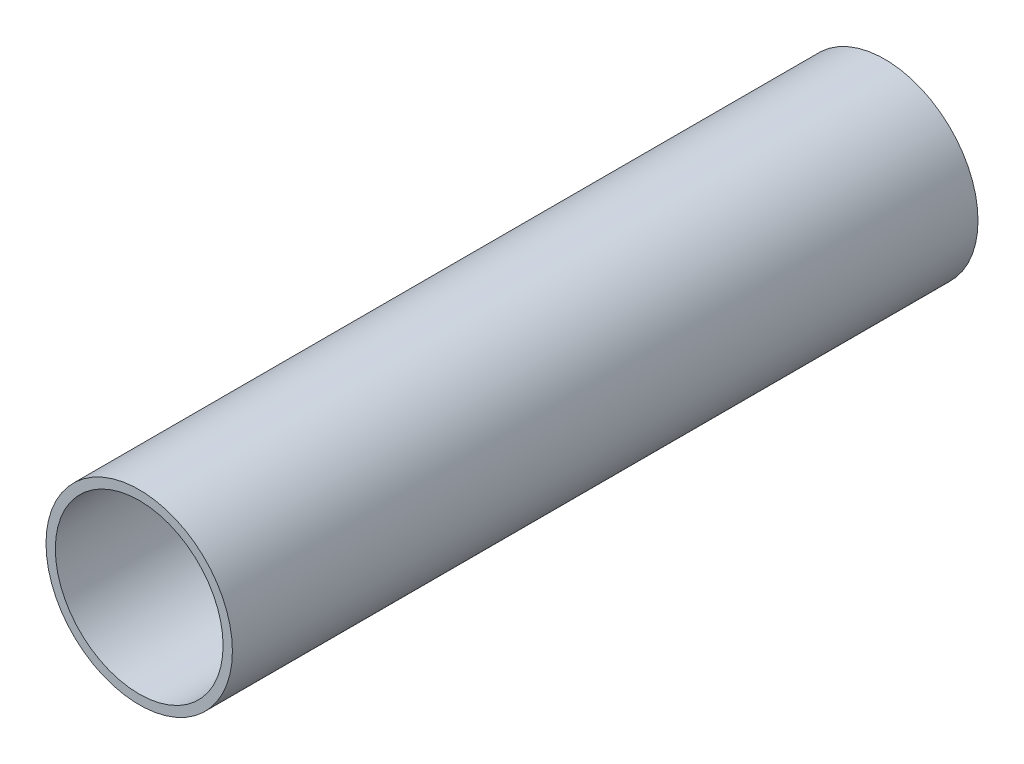
ISO-10303-21;
HEADER;
FILE_DESCRIPTION(('STEP AP214'),'2;1');
FILE_NAME('part.step','',(''),(''),'','','');
FILE_SCHEMA(('AUTOMOTIVE_DESIGN { 1 0 10303 214 1 1 1 1 }'));
ENDSEC;
DATA;
#1=APPLICATION_CONTEXT('core data for automotive mechanical design processes');
#2=APPLICATION_PROTOCOL_DEFINITION('international standard','automotive_design',2000,#1);
#3=PRODUCT_CONTEXT('',#1,'mechanical');
#4=PRODUCT('Part','Part','',(#3));
#5=PRODUCT_RELATED_PRODUCT_CATEGORY('part','',(#4));
#6=PRODUCT_DEFINITION_FORMATION('','',#4);
#7=PRODUCT_DEFINITION_CONTEXT('part definition',#1,'design');
#8=PRODUCT_DEFINITION('design','',#6,#7);
#9=PRODUCT_DEFINITION_SHAPE('','',#8);
#10=(LENGTH_UNIT() NAMED_UNIT(*) SI_UNIT(.MILLI.,.METRE.));
#11=(NAMED_UNIT(*) PLANE_ANGLE_UNIT() SI_UNIT($,.RADIAN.));
#12=(NAMED_UNIT(*) SI_UNIT($,.STERADIAN.) SOLID_ANGLE_UNIT());
#13=UNCERTAINTY_MEASURE_WITH_UNIT(LENGTH_MEASURE(1.E-05),#10,'distance_accuracy_value','');
#14=(GEOMETRIC_REPRESENTATION_CONTEXT(3) GLOBAL_UNCERTAINTY_ASSIGNED_CONTEXT((#13)) GLOBAL_UNIT_ASSIGNED_CONTEXT((#10,
#11,#12)) REPRESENTATION_CONTEXT('',''));
#15=CARTESIAN_POINT('',(0.,0.,0.));
#16=DIRECTION('',(0.,0.,1.));
#17=DIRECTION('',(1.,0.,0.));
#18=AXIS2_PLACEMENT_3D('',#15,#16,#17);
#19=CARTESIAN_POINT('',(0.,0.,400.));
#20=DIRECTION('',(0.,0.,1.));
#21=DIRECTION('',(1.,0.,0.));
#22=AXIS2_PLACEMENT_3D('',#19,#20,#21);
#23=PLANE('',#22);
#24=CARTESIAN_POINT('',(0.,0.,400.));
#25=DIRECTION('',(0.,0.,1.));
#26=DIRECTION('',(1.,0.,0.));
#27=AXIS2_PLACEMENT_3D('',#24,#25,#26);
#28=CIRCLE('',#27,50.);
#29=CARTESIAN_POINT('',(50.,0.,400.));
#30=VERTEX_POINT('',#29);
#31=EDGE_CURVE('E10',#30,#30,#28,.T.);
#32=ORIENTED_EDGE('',*,*,#31,.T.);
#33=EDGE_LOOP('',(#32));
#34=FACE_BOUND('',#33,.T.);
#35=CARTESIAN_POINT('',(0.,0.,400.));
#36=DIRECTION('',(0.,0.,1.));
#37=DIRECTION('',(1.,0.,0.));
#38=AXIS2_PLACEMENT_3D('',#35,#36,#37);
#39=CIRCLE('',#38,45.);
#40=CARTESIAN_POINT('',(45.,0.,400.));
#41=VERTEX_POINT('',#40);
#42=EDGE_CURVE('E56',#41,#41,#39,.T.);
#43=ORIENTED_EDGE('',*,*,#42,.F.);
#44=EDGE_LOOP('',(#43));
#45=FACE_BOUND('',#44,.T.);
#46=ADVANCED_FACE('F43',(#34,#45),#23,.T.);
#47=CARTESIAN_POINT('',(0.,0.,0.));
#48=DIRECTION('',(0.,0.,1.));
#49=DIRECTION('',(1.,0.,0.));
#50=AXIS2_PLACEMENT_3D('',#47,#48,#49);
#51=PLANE('',#50);
#52=CARTESIAN_POINT('',(0.,0.,0.));
#53=DIRECTION('',(0.,0.,1.));
#54=DIRECTION('',(1.,0.,0.));
#55=AXIS2_PLACEMENT_3D('',#52,#53,#54);
#56=CIRCLE('',#55,50.);
#57=CARTESIAN_POINT('',(50.,0.,0.));
#58=VERTEX_POINT('',#57);
#59=EDGE_CURVE('E47',#58,#58,#56,.T.);
#60=ORIENTED_EDGE('',*,*,#59,.F.);
#61=EDGE_LOOP('',(#60));
#62=FACE_BOUND('',#61,.T.);
#63=CARTESIAN_POINT('',(0.,0.,0.));
#64=DIRECTION('',(0.,0.,1.));
#65=DIRECTION('',(1.,0.,0.));
#66=AXIS2_PLACEMENT_3D('',#63,#64,#65);
#67=CIRCLE('',#66,45.);
#68=CARTESIAN_POINT('',(45.,0.,0.));
#69=VERTEX_POINT('',#68);
#70=EDGE_CURVE('E58',#69,#69,#67,.T.);
#71=ORIENTED_EDGE('',*,*,#70,.T.);
#72=EDGE_LOOP('',(#71));
#73=FACE_BOUND('',#72,.T.);
#74=ADVANCED_FACE('F70',(#62,#73),#51,.F.);
#75=CARTESIAN_POINT('',(0.,0.,400.));
#76=DIRECTION('',(0.,0.,-1.));
#77=DIRECTION('',(-1.,0.,0.));
#78=AXIS2_PLACEMENT_3D('',#75,#76,#77);
#79=CYLINDRICAL_SURFACE('',#78,50.);
#80=ORIENTED_EDGE('',*,*,#31,.F.);
#81=EDGE_LOOP('',(#80));
#82=FACE_BOUND('',#81,.T.);
#83=ORIENTED_EDGE('',*,*,#59,.T.);
#84=EDGE_LOOP('',(#83));
#85=FACE_BOUND('',#84,.T.);
#86=ADVANCED_FACE('F45',(#82,#85),#79,.T.);
#87=CARTESIAN_POINT('',(0.,0.,400.));
#88=DIRECTION('',(0.,0.,-1.));
#89=DIRECTION('',(-1.,0.,0.));
#90=AXIS2_PLACEMENT_3D('',#87,#88,#89);
#91=CYLINDRICAL_SURFACE('',#90,45.);
#92=ORIENTED_EDGE('',*,*,#42,.T.);
#93=EDGE_LOOP('',(#92));
#94=FACE_BOUND('',#93,.T.);
#95=ORIENTED_EDGE('',*,*,#70,.F.);
#96=EDGE_LOOP('',(#95));
#97=FACE_BOUND('',#96,.T.);
#98=ADVANCED_FACE('F66',(#94,#97),#91,.F.);
#99=CLOSED_SHELL('',(#46,#74,#86,#98));
#100=MANIFOLD_SOLID_BREP('B2',#99);
#101=ADVANCED_BREP_SHAPE_REPRESENTATION('',(#18,#100),#14);
#102=SHAPE_DEFINITION_REPRESENTATION(#9,#101);
ENDSEC;
END-ISO-10303-21;
